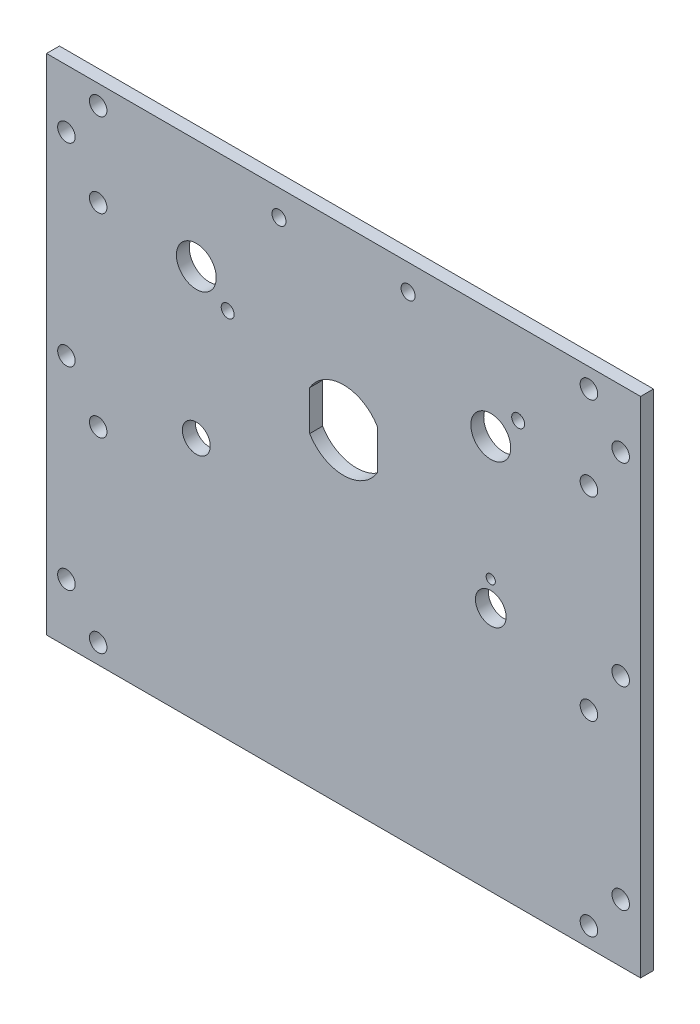
ISO-10303-21;
HEADER;
FILE_DESCRIPTION(('STEP AP214'),'2;1');
FILE_NAME('part.step','',(''),(''),'','','');
FILE_SCHEMA(('AUTOMOTIVE_DESIGN { 1 0 10303 214 1 1 1 1 }'));
ENDSEC;
DATA;
#1=APPLICATION_CONTEXT('core data for automotive mechanical design processes');
#2=APPLICATION_PROTOCOL_DEFINITION('international standard','automotive_design',2000,#1);
#3=PRODUCT_CONTEXT('',#1,'mechanical');
#4=PRODUCT('Part','Part','',(#3));
#5=PRODUCT_RELATED_PRODUCT_CATEGORY('part','',(#4));
#6=PRODUCT_DEFINITION_FORMATION('','',#4);
#7=PRODUCT_DEFINITION_CONTEXT('part definition',#1,'design');
#8=PRODUCT_DEFINITION('design','',#6,#7);
#9=PRODUCT_DEFINITION_SHAPE('','',#8);
#10=(LENGTH_UNIT() NAMED_UNIT(*) SI_UNIT(.MILLI.,.METRE.));
#11=(NAMED_UNIT(*) PLANE_ANGLE_UNIT() SI_UNIT($,.RADIAN.));
#12=(NAMED_UNIT(*) SI_UNIT($,.STERADIAN.) SOLID_ANGLE_UNIT());
#13=UNCERTAINTY_MEASURE_WITH_UNIT(LENGTH_MEASURE(1.E-05),#10,'distance_accuracy_value','');
#14=(GEOMETRIC_REPRESENTATION_CONTEXT(3) GLOBAL_UNCERTAINTY_ASSIGNED_CONTEXT((#13)) GLOBAL_UNIT_ASSIGNED_CONTEXT((#10,
#11,#12)) REPRESENTATION_CONTEXT('',''));
#15=CARTESIAN_POINT('',(0.,0.,0.));
#16=DIRECTION('',(0.,0.,1.));
#17=DIRECTION('',(1.,0.,0.));
#18=AXIS2_PLACEMENT_3D('',#15,#16,#17);
#19=CARTESIAN_POINT('',(0.,0.,-3.175));
#20=DIRECTION('',(1.,0.,0.));
#21=DIRECTION('',(0.,1.,0.));
#22=AXIS2_PLACEMENT_3D('',#19,#20,#21);
#23=PLANE('',#22);
#24=DIRECTION('',(0.,1.,0.));
#25=VECTOR('',#24,1.);
#26=CARTESIAN_POINT('',(0.,0.,0.));
#27=LINE('',#26,#25);
#28=CARTESIAN_POINT('',(0.,0.,0.));
#29=VERTEX_POINT('',#28);
#30=CARTESIAN_POINT('',(0.,123.825,0.));
#31=VERTEX_POINT('',#30);
#32=EDGE_CURVE('E317',#29,#31,#27,.T.);
#33=ORIENTED_EDGE('',*,*,#32,.F.);
#34=DIRECTION('',(0.,0.,1.));
#35=VECTOR('',#34,1.);
#36=CARTESIAN_POINT('',(0.,0.,-3.175));
#37=LINE('',#36,#35);
#38=CARTESIAN_POINT('',(0.,0.,-3.175));
#39=VERTEX_POINT('',#38);
#40=EDGE_CURVE('E11',#39,#29,#37,.T.);
#41=ORIENTED_EDGE('',*,*,#40,.F.);
#42=DIRECTION('',(0.,1.,0.));
#43=VECTOR('',#42,1.);
#44=CARTESIAN_POINT('',(0.,0.,-3.175));
#45=LINE('',#44,#43);
#46=CARTESIAN_POINT('',(0.,123.825,-3.175));
#47=VERTEX_POINT('',#46);
#48=EDGE_CURVE('E318',#39,#47,#45,.T.);
#49=ORIENTED_EDGE('',*,*,#48,.T.);
#50=DIRECTION('',(0.,0.,1.));
#51=VECTOR('',#50,1.);
#52=CARTESIAN_POINT('',(0.,123.825,-3.175));
#53=LINE('',#52,#51);
#54=EDGE_CURVE('E42',#47,#31,#53,.T.);
#55=ORIENTED_EDGE('',*,*,#54,.T.);
#56=EDGE_LOOP('',(#33,#41,#49,#55));
#57=FACE_BOUND('',#56,.T.);
#58=ADVANCED_FACE('F39',(#57),#23,.T.);
#59=CARTESIAN_POINT('',(-146.05,0.,-3.175));
#60=DIRECTION('',(0.,-1.,0.));
#61=DIRECTION('',(1.,0.,0.));
#62=AXIS2_PLACEMENT_3D('',#59,#60,#61);
#63=PLANE('',#62);
#64=DIRECTION('',(1.,0.,0.));
#65=VECTOR('',#64,1.);
#66=CARTESIAN_POINT('',(-146.05,0.,0.));
#67=LINE('',#66,#65);
#68=CARTESIAN_POINT('',(-146.05,0.,0.));
#69=VERTEX_POINT('',#68);
#70=EDGE_CURVE('E323',#69,#29,#67,.T.);
#71=ORIENTED_EDGE('',*,*,#70,.F.);
#72=DIRECTION('',(0.,0.,1.));
#73=VECTOR('',#72,1.);
#74=CARTESIAN_POINT('',(-146.05,0.,-3.175));
#75=LINE('',#74,#73);
#76=CARTESIAN_POINT('',(-146.05,0.,-3.175));
#77=VERTEX_POINT('',#76);
#78=EDGE_CURVE('E48',#77,#69,#75,.T.);
#79=ORIENTED_EDGE('',*,*,#78,.F.);
#80=DIRECTION('',(1.,0.,0.));
#81=VECTOR('',#80,1.);
#82=CARTESIAN_POINT('',(-146.05,0.,-3.175));
#83=LINE('',#82,#81);
#84=EDGE_CURVE('E331',#77,#39,#83,.T.);
#85=ORIENTED_EDGE('',*,*,#84,.T.);
#86=ORIENTED_EDGE('',*,*,#40,.T.);
#87=EDGE_LOOP('',(#71,#79,#85,#86));
#88=FACE_BOUND('',#87,.T.);
#89=ADVANCED_FACE('F364',(#88),#63,.T.);
#90=CARTESIAN_POINT('',(-146.05,123.825,-3.175));
#91=DIRECTION('',(-1.,0.,0.));
#92=DIRECTION('',(0.,0.,1.));
#93=AXIS2_PLACEMENT_3D('',#90,#91,#92);
#94=PLANE('',#93);
#95=DIRECTION('',(0.,-1.,0.));
#96=VECTOR('',#95,1.);
#97=CARTESIAN_POINT('',(-146.05,123.825,0.));
#98=LINE('',#97,#96);
#99=CARTESIAN_POINT('',(-146.05,123.825,0.));
#100=VERTEX_POINT('',#99);
#101=EDGE_CURVE('E342',#100,#69,#98,.T.);
#102=ORIENTED_EDGE('',*,*,#101,.F.);
#103=DIRECTION('',(0.,0.,1.));
#104=VECTOR('',#103,1.);
#105=CARTESIAN_POINT('',(-146.05,123.825,-3.175));
#106=LINE('',#105,#104);
#107=CARTESIAN_POINT('',(-146.05,123.825,-3.175));
#108=VERTEX_POINT('',#107);
#109=EDGE_CURVE('E350',#108,#100,#106,.T.);
#110=ORIENTED_EDGE('',*,*,#109,.F.);
#111=DIRECTION('',(0.,-1.,0.));
#112=VECTOR('',#111,1.);
#113=CARTESIAN_POINT('',(-146.05,123.825,-3.175));
#114=LINE('',#113,#112);
#115=EDGE_CURVE('E327',#108,#77,#114,.T.);
#116=ORIENTED_EDGE('',*,*,#115,.T.);
#117=ORIENTED_EDGE('',*,*,#78,.T.);
#118=EDGE_LOOP('',(#102,#110,#116,#117));
#119=FACE_BOUND('',#118,.T.);
#120=ADVANCED_FACE('F370',(#119),#94,.T.);
#121=CARTESIAN_POINT('',(0.,123.825,-3.175));
#122=DIRECTION('',(0.,1.,0.));
#123=DIRECTION('',(0.,0.,1.));
#124=AXIS2_PLACEMENT_3D('',#121,#122,#123);
#125=PLANE('',#124);
#126=DIRECTION('',(-1.,0.,0.));
#127=VECTOR('',#126,1.);
#128=CARTESIAN_POINT('',(0.,123.825,0.));
#129=LINE('',#128,#127);
#130=EDGE_CURVE('E338',#31,#100,#129,.T.);
#131=ORIENTED_EDGE('',*,*,#130,.F.);
#132=ORIENTED_EDGE('',*,*,#54,.F.);
#133=DIRECTION('',(-1.,0.,0.));
#134=VECTOR('',#133,1.);
#135=CARTESIAN_POINT('',(0.,123.825,-3.175));
#136=LINE('',#135,#134);
#137=EDGE_CURVE('E322',#47,#108,#136,.T.);
#138=ORIENTED_EDGE('',*,*,#137,.T.);
#139=ORIENTED_EDGE('',*,*,#109,.T.);
#140=EDGE_LOOP('',(#131,#132,#138,#139));
#141=FACE_BOUND('',#140,.T.);
#142=ADVANCED_FACE('F360',(#141),#125,.T.);
#143=CARTESIAN_POINT('',(0.,0.,-3.175));
#144=DIRECTION('',(0.,0.,1.));
#145=DIRECTION('',(1.,0.,0.));
#146=AXIS2_PLACEMENT_3D('',#143,#144,#145);
#147=PLANE('',#146);
#148=CARTESIAN_POINT('',(-88.9,117.475,-3.175));
#149=DIRECTION('',(0.,0.,1.));
#150=DIRECTION('',(1.,0.,0.));
#151=AXIS2_PLACEMENT_3D('',#148,#149,#150);
#152=CIRCLE('',#151,1.7272);
#153=CARTESIAN_POINT('',(-87.1728,117.475,-3.175));
#154=VERTEX_POINT('',#153);
#155=EDGE_CURVE('E685',#154,#154,#152,.T.);
#156=ORIENTED_EDGE('',*,*,#155,.T.);
#157=EDGE_LOOP('',(#156));
#158=FACE_BOUND('',#157,.T.);
#159=CARTESIAN_POINT('',(-57.15,117.475,-3.175));
#160=DIRECTION('',(0.,0.,1.));
#161=DIRECTION('',(1.,0.,0.));
#162=AXIS2_PLACEMENT_3D('',#159,#160,#161);
#163=CIRCLE('',#162,1.7272);
#164=CARTESIAN_POINT('',(-55.4228,117.475,-3.175));
#165=VERTEX_POINT('',#164);
#166=EDGE_CURVE('E698',#165,#165,#163,.T.);
#167=ORIENTED_EDGE('',*,*,#166,.T.);
#168=EDGE_LOOP('',(#167));
#169=FACE_BOUND('',#168,.T.);
#170=CARTESIAN_POINT('',(-30.094807909198,103.636192090802,-3.175));
#171=DIRECTION('',(0.,0.,-1.));
#172=DIRECTION('',(-1.,0.,0.));
#173=AXIS2_PLACEMENT_3D('',#170,#171,#172);
#174=CIRCLE('',#173,1.5875);
#175=CARTESIAN_POINT('',(-31.682307909198,103.636192090802,-3.175));
#176=VERTEX_POINT('',#175);
#177=EDGE_CURVE('E133',#176,#176,#174,.T.);
#178=ORIENTED_EDGE('',*,*,#177,.F.);
#179=EDGE_LOOP('',(#178));
#180=FACE_BOUND('',#179,.T.);
#181=DIRECTION('',(0.,-1.,0.));
#182=VECTOR('',#181,1.);
#183=CARTESIAN_POINT('',(-64.7065,75.2417306764591,-3.175));
#184=LINE('',#183,#182);
#185=CARTESIAN_POINT('',(-64.7065,85.0322693235408,-3.175));
#186=VERTEX_POINT('',#185);
#187=CARTESIAN_POINT('',(-64.7065,75.2417306764591,-3.175));
#188=VERTEX_POINT('',#187);
#189=EDGE_CURVE('E142',#186,#188,#184,.T.);
#190=ORIENTED_EDGE('',*,*,#189,.F.);
#191=CARTESIAN_POINT('',(-73.025,80.137,-3.175));
#192=DIRECTION('',(0.,0.,-1.));
#193=DIRECTION('',(-1.,0.,0.));
#194=AXIS2_PLACEMENT_3D('',#191,#192,#193);
#195=CIRCLE('',#194,9.652);
#196=CARTESIAN_POINT('',(-81.3435,85.0322693235408,-3.175));
#197=VERTEX_POINT('',#196);
#198=EDGE_CURVE('E56',#197,#186,#195,.T.);
#199=ORIENTED_EDGE('',*,*,#198,.F.);
#200=DIRECTION('',(0.,1.,0.));
#201=VECTOR('',#200,1.);
#202=CARTESIAN_POINT('',(-81.3435,85.0322693235408,-3.175));
#203=LINE('',#202,#201);
#204=CARTESIAN_POINT('',(-81.3435,75.2417306764592,-3.175));
#205=VERTEX_POINT('',#204);
#206=EDGE_CURVE('E126',#205,#197,#203,.T.);
#207=ORIENTED_EDGE('',*,*,#206,.F.);
#208=CARTESIAN_POINT('',(-73.025,80.137,-3.175));
#209=DIRECTION('',(0.,0.,-1.));
#210=DIRECTION('',(-1.,0.,0.));
#211=AXIS2_PLACEMENT_3D('',#208,#209,#210);
#212=CIRCLE('',#211,9.652);
#213=EDGE_CURVE('E130',#188,#205,#212,.T.);
#214=ORIENTED_EDGE('',*,*,#213,.F.);
#215=EDGE_LOOP('',(#190,#199,#207,#214));
#216=FACE_BOUND('',#215,.T.);
#217=CARTESIAN_POINT('',(-109.22,96.901,-3.175));
#218=DIRECTION('',(0.,0.,-1.));
#219=DIRECTION('',(-1.,0.,0.));
#220=AXIS2_PLACEMENT_3D('',#217,#218,#219);
#221=CIRCLE('',#220,4.9022);
#222=CARTESIAN_POINT('',(-114.1222,96.901,-3.175));
#223=VERTEX_POINT('',#222);
#224=EDGE_CURVE('E152',#223,#223,#221,.T.);
#225=ORIENTED_EDGE('',*,*,#224,.F.);
#226=EDGE_LOOP('',(#225));
#227=FACE_BOUND('',#226,.T.);
#228=CARTESIAN_POINT('',(-36.8300000273551,66.525,-3.175));
#229=DIRECTION('',(0.,0.,-1.));
#230=DIRECTION('',(-1.,0.,0.));
#231=AXIS2_PLACEMENT_3D('',#228,#229,#230);
#232=CIRCLE('',#231,1.125);
#233=CARTESIAN_POINT('',(-37.9550000273551,66.525,-3.175));
#234=VERTEX_POINT('',#233);
#235=EDGE_CURVE('E162',#234,#234,#232,.T.);
#236=ORIENTED_EDGE('',*,*,#235,.F.);
#237=EDGE_LOOP('',(#236));
#238=FACE_BOUND('',#237,.T.);
#239=CARTESIAN_POINT('',(-101.514113128579,91.3023454719142,-3.175));
#240=DIRECTION('',(0.,0.,-1.));
#241=DIRECTION('',(-1.,0.,0.));
#242=AXIS2_PLACEMENT_3D('',#239,#240,#241);
#243=CIRCLE('',#242,1.58749999999999);
#244=CARTESIAN_POINT('',(-103.101613128579,91.3023454719142,-3.175));
#245=VERTEX_POINT('',#244);
#246=EDGE_CURVE('E170',#245,#245,#243,.T.);
#247=ORIENTED_EDGE('',*,*,#246,.F.);
#248=EDGE_LOOP('',(#247));
#249=FACE_BOUND('',#248,.T.);
#250=CARTESIAN_POINT('',(-109.22,60.325,-3.175));
#251=DIRECTION('',(0.,0.,-1.));
#252=DIRECTION('',(-1.,0.,0.));
#253=AXIS2_PLACEMENT_3D('',#250,#251,#252);
#254=CIRCLE('',#253,3.429);
#255=CARTESIAN_POINT('',(-112.649,60.325,-3.175));
#256=VERTEX_POINT('',#255);
#257=EDGE_CURVE('E178',#256,#256,#254,.T.);
#258=ORIENTED_EDGE('',*,*,#257,.F.);
#259=EDGE_LOOP('',(#258));
#260=FACE_BOUND('',#259,.T.);
#261=CARTESIAN_POINT('',(-36.83,60.325,-3.175));
#262=DIRECTION('',(0.,0.,-1.));
#263=DIRECTION('',(-1.,0.,0.));
#264=AXIS2_PLACEMENT_3D('',#261,#262,#263);
#265=CIRCLE('',#264,3.7703125);
#266=CARTESIAN_POINT('',(-40.6003125,60.325,-3.175));
#267=VERTEX_POINT('',#266);
#268=EDGE_CURVE('E186',#267,#267,#265,.T.);
#269=ORIENTED_EDGE('',*,*,#268,.F.);
#270=EDGE_LOOP('',(#269));
#271=FACE_BOUND('',#270,.T.);
#272=CARTESIAN_POINT('',(-36.83,96.901,-3.175));
#273=DIRECTION('',(0.,0.,-1.));
#274=DIRECTION('',(-1.,0.,0.));
#275=AXIS2_PLACEMENT_3D('',#272,#273,#274);
#276=CIRCLE('',#275,4.90220000000001);
#277=CARTESIAN_POINT('',(-41.7322,96.901,-3.175));
#278=VERTEX_POINT('',#277);
#279=EDGE_CURVE('E194',#278,#278,#276,.T.);
#280=ORIENTED_EDGE('',*,*,#279,.F.);
#281=EDGE_LOOP('',(#280));
#282=FACE_BOUND('',#281,.T.);
#283=CARTESIAN_POINT('',(-12.7,119.0625,-3.175));
#284=DIRECTION('',(0.,0.,-1.));
#285=DIRECTION('',(-1.,0.,0.));
#286=AXIS2_PLACEMENT_3D('',#283,#284,#285);
#287=CIRCLE('',#286,2.15265);
#288=CARTESIAN_POINT('',(-14.85265,119.0625,-3.175));
#289=VERTEX_POINT('',#288);
#290=EDGE_CURVE('E202',#289,#289,#287,.T.);
#291=ORIENTED_EDGE('',*,*,#290,.F.);
#292=EDGE_LOOP('',(#291));
#293=FACE_BOUND('',#292,.T.);
#294=CARTESIAN_POINT('',(-133.35,119.0625,-3.175));
#295=DIRECTION('',(0.,0.,-1.));
#296=DIRECTION('',(-1.,0.,0.));
#297=AXIS2_PLACEMENT_3D('',#294,#295,#296);
#298=CIRCLE('',#297,2.15265000000001);
#299=CARTESIAN_POINT('',(-135.50265,119.0625,-3.175));
#300=VERTEX_POINT('',#299);
#301=EDGE_CURVE('E213',#300,#300,#298,.T.);
#302=ORIENTED_EDGE('',*,*,#301,.F.);
#303=EDGE_LOOP('',(#302));
#304=FACE_BOUND('',#303,.T.);
#305=CARTESIAN_POINT('',(-141.1605,109.5375,-3.175));
#306=DIRECTION('',(0.,0.,-1.));
#307=DIRECTION('',(-1.,0.,0.));
#308=AXIS2_PLACEMENT_3D('',#305,#306,#307);
#309=CIRCLE('',#308,2.15265000000001);
#310=CARTESIAN_POINT('',(-143.31315,109.5375,-3.175));
#311=VERTEX_POINT('',#310);
#312=EDGE_CURVE('E221',#311,#311,#309,.T.);
#313=ORIENTED_EDGE('',*,*,#312,.F.);
#314=EDGE_LOOP('',(#313));
#315=FACE_BOUND('',#314,.T.);
#316=CARTESIAN_POINT('',(-133.35,98.425,-3.175));
#317=DIRECTION('',(0.,0.,-1.));
#318=DIRECTION('',(-1.,0.,0.));
#319=AXIS2_PLACEMENT_3D('',#316,#317,#318);
#320=CIRCLE('',#319,2.15265000000001);
#321=CARTESIAN_POINT('',(-135.50265,98.425,-3.175));
#322=VERTEX_POINT('',#321);
#323=EDGE_CURVE('E229',#322,#322,#320,.T.);
#324=ORIENTED_EDGE('',*,*,#323,.F.);
#325=EDGE_LOOP('',(#324));
#326=FACE_BOUND('',#325,.T.);
#327=CARTESIAN_POINT('',(-141.1605,61.9125,-3.175));
#328=DIRECTION('',(0.,0.,-1.));
#329=DIRECTION('',(-1.,0.,0.));
#330=AXIS2_PLACEMENT_3D('',#327,#328,#329);
#331=CIRCLE('',#330,2.15265000000001);
#332=CARTESIAN_POINT('',(-143.31315,61.9125,-3.175));
#333=VERTEX_POINT('',#332);
#334=EDGE_CURVE('E237',#333,#333,#331,.T.);
#335=ORIENTED_EDGE('',*,*,#334,.F.);
#336=EDGE_LOOP('',(#335));
#337=FACE_BOUND('',#336,.T.);
#338=CARTESIAN_POINT('',(-133.35,50.673,-3.175));
#339=DIRECTION('',(0.,0.,-1.));
#340=DIRECTION('',(-1.,0.,0.));
#341=AXIS2_PLACEMENT_3D('',#338,#339,#340);
#342=CIRCLE('',#341,2.15265000000001);
#343=CARTESIAN_POINT('',(-135.50265,50.673,-3.175));
#344=VERTEX_POINT('',#343);
#345=EDGE_CURVE('E245',#344,#344,#342,.T.);
#346=ORIENTED_EDGE('',*,*,#345,.F.);
#347=EDGE_LOOP('',(#346));
#348=FACE_BOUND('',#347,.T.);
#349=CARTESIAN_POINT('',(-133.35,4.7625,-3.175));
#350=DIRECTION('',(0.,0.,-1.));
#351=DIRECTION('',(-1.,0.,0.));
#352=AXIS2_PLACEMENT_3D('',#349,#350,#351);
#353=CIRCLE('',#352,2.15265000000001);
#354=CARTESIAN_POINT('',(-135.50265,4.7625,-3.175));
#355=VERTEX_POINT('',#354);
#356=EDGE_CURVE('E253',#355,#355,#353,.T.);
#357=ORIENTED_EDGE('',*,*,#356,.F.);
#358=EDGE_LOOP('',(#357));
#359=FACE_BOUND('',#358,.T.);
#360=CARTESIAN_POINT('',(-12.7,4.7625,-3.175));
#361=DIRECTION('',(0.,0.,-1.));
#362=DIRECTION('',(-1.,0.,0.));
#363=AXIS2_PLACEMENT_3D('',#360,#361,#362);
#364=CIRCLE('',#363,2.15265);
#365=CARTESIAN_POINT('',(-14.85265,4.7625,-3.175));
#366=VERTEX_POINT('',#365);
#367=EDGE_CURVE('E261',#366,#366,#364,.T.);
#368=ORIENTED_EDGE('',*,*,#367,.F.);
#369=EDGE_LOOP('',(#368));
#370=FACE_BOUND('',#369,.T.);
#371=CARTESIAN_POINT('',(-12.7,50.673,-3.175));
#372=DIRECTION('',(0.,0.,-1.));
#373=DIRECTION('',(-1.,0.,0.));
#374=AXIS2_PLACEMENT_3D('',#371,#372,#373);
#375=CIRCLE('',#374,2.15265);
#376=CARTESIAN_POINT('',(-14.85265,50.673,-3.175));
#377=VERTEX_POINT('',#376);
#378=EDGE_CURVE('E269',#377,#377,#375,.T.);
#379=ORIENTED_EDGE('',*,*,#378,.F.);
#380=EDGE_LOOP('',(#379));
#381=FACE_BOUND('',#380,.T.);
#382=CARTESIAN_POINT('',(-12.7,98.425,-3.175));
#383=DIRECTION('',(0.,0.,-1.));
#384=DIRECTION('',(-1.,0.,0.));
#385=AXIS2_PLACEMENT_3D('',#382,#383,#384);
#386=CIRCLE('',#385,2.15265);
#387=CARTESIAN_POINT('',(-14.85265,98.425,-3.175));
#388=VERTEX_POINT('',#387);
#389=EDGE_CURVE('E277',#388,#388,#386,.T.);
#390=ORIENTED_EDGE('',*,*,#389,.F.);
#391=EDGE_LOOP('',(#390));
#392=FACE_BOUND('',#391,.T.);
#393=CARTESIAN_POINT('',(-4.8895,109.5375,-3.175));
#394=DIRECTION('',(0.,0.,-1.));
#395=DIRECTION('',(-1.,0.,0.));
#396=AXIS2_PLACEMENT_3D('',#393,#394,#395);
#397=CIRCLE('',#396,2.15265);
#398=CARTESIAN_POINT('',(-7.04215,109.5375,-3.175));
#399=VERTEX_POINT('',#398);
#400=EDGE_CURVE('E285',#399,#399,#397,.T.);
#401=ORIENTED_EDGE('',*,*,#400,.F.);
#402=EDGE_LOOP('',(#401));
#403=FACE_BOUND('',#402,.T.);
#404=CARTESIAN_POINT('',(-141.1605,14.2875,-3.175));
#405=DIRECTION('',(0.,0.,-1.));
#406=DIRECTION('',(-1.,0.,0.));
#407=AXIS2_PLACEMENT_3D('',#404,#405,#406);
#408=CIRCLE('',#407,2.15265000000001);
#409=CARTESIAN_POINT('',(-143.31315,14.2875,-3.175));
#410=VERTEX_POINT('',#409);
#411=EDGE_CURVE('E293',#410,#410,#408,.T.);
#412=ORIENTED_EDGE('',*,*,#411,.F.);
#413=EDGE_LOOP('',(#412));
#414=FACE_BOUND('',#413,.T.);
#415=CARTESIAN_POINT('',(-4.88949999999997,14.2875,-3.175));
#416=DIRECTION('',(0.,0.,-1.));
#417=DIRECTION('',(-1.,0.,0.));
#418=AXIS2_PLACEMENT_3D('',#415,#416,#417);
#419=CIRCLE('',#418,2.15265);
#420=CARTESIAN_POINT('',(-7.04214999999997,14.2875,-3.175));
#421=VERTEX_POINT('',#420);
#422=EDGE_CURVE('E301',#421,#421,#419,.T.);
#423=ORIENTED_EDGE('',*,*,#422,.F.);
#424=EDGE_LOOP('',(#423));
#425=FACE_BOUND('',#424,.T.);
#426=CARTESIAN_POINT('',(-4.8895,61.9125,-3.175));
#427=DIRECTION('',(0.,0.,-1.));
#428=DIRECTION('',(-1.,0.,0.));
#429=AXIS2_PLACEMENT_3D('',#426,#427,#428);
#430=CIRCLE('',#429,2.15265);
#431=CARTESIAN_POINT('',(-7.04215,61.9125,-3.175));
#432=VERTEX_POINT('',#431);
#433=EDGE_CURVE('E309',#432,#432,#430,.T.);
#434=ORIENTED_EDGE('',*,*,#433,.F.);
#435=EDGE_LOOP('',(#434));
#436=FACE_BOUND('',#435,.T.);
#437=ORIENTED_EDGE('',*,*,#48,.F.);
#438=ORIENTED_EDGE('',*,*,#84,.F.);
#439=ORIENTED_EDGE('',*,*,#115,.F.);
#440=ORIENTED_EDGE('',*,*,#137,.F.);
#441=EDGE_LOOP('',(#437,#438,#439,#440));
#442=FACE_BOUND('',#441,.T.);
#443=ADVANCED_FACE('F367',(#158,#169,#180,#216,#227,#238,#249,#260,#271,#282,#293,#304,#315,
#326,#337,#348,#359,#370,#381,#392,#403,#414,#425,#436,#442),#147,.F.);
#444=CARTESIAN_POINT('',(0.,0.,0.));
#445=DIRECTION('',(0.,0.,1.));
#446=DIRECTION('',(1.,0.,0.));
#447=AXIS2_PLACEMENT_3D('',#444,#445,#446);
#448=PLANE('',#447);
#449=CARTESIAN_POINT('',(-88.9,117.475,0.));
#450=DIRECTION('',(0.,0.,1.));
#451=DIRECTION('',(1.,0.,0.));
#452=AXIS2_PLACEMENT_3D('',#449,#450,#451);
#453=CIRCLE('',#452,1.7272);
#454=CARTESIAN_POINT('',(-87.1728,117.475,0.));
#455=VERTEX_POINT('',#454);
#456=EDGE_CURVE('E688',#455,#455,#453,.T.);
#457=ORIENTED_EDGE('',*,*,#456,.F.);
#458=EDGE_LOOP('',(#457));
#459=FACE_BOUND('',#458,.T.);
#460=CARTESIAN_POINT('',(-57.15,117.475,0.));
#461=DIRECTION('',(0.,0.,1.));
#462=DIRECTION('',(1.,0.,0.));
#463=AXIS2_PLACEMENT_3D('',#460,#461,#462);
#464=CIRCLE('',#463,1.7272);
#465=CARTESIAN_POINT('',(-55.4228,117.475,0.));
#466=VERTEX_POINT('',#465);
#467=EDGE_CURVE('E692',#466,#466,#464,.T.);
#468=ORIENTED_EDGE('',*,*,#467,.F.);
#469=EDGE_LOOP('',(#468));
#470=FACE_BOUND('',#469,.T.);
#471=CARTESIAN_POINT('',(-30.094807909198,103.636192090802,0.));
#472=DIRECTION('',(0.,0.,-1.));
#473=DIRECTION('',(-1.,0.,0.));
#474=AXIS2_PLACEMENT_3D('',#471,#472,#473);
#475=CIRCLE('',#474,1.5875);
#476=CARTESIAN_POINT('',(-31.682307909198,103.636192090802,0.));
#477=VERTEX_POINT('',#476);
#478=EDGE_CURVE('E143',#477,#477,#475,.T.);
#479=ORIENTED_EDGE('',*,*,#478,.T.);
#480=EDGE_LOOP('',(#479));
#481=FACE_BOUND('',#480,.T.);
#482=CARTESIAN_POINT('',(-73.025,80.137,0.));
#483=DIRECTION('',(0.,0.,-1.));
#484=DIRECTION('',(-1.,0.,0.));
#485=AXIS2_PLACEMENT_3D('',#482,#483,#484);
#486=CIRCLE('',#485,9.652);
#487=CARTESIAN_POINT('',(-81.3435,85.0322693235408,0.));
#488=VERTEX_POINT('',#487);
#489=CARTESIAN_POINT('',(-64.7065,85.0322693235408,0.));
#490=VERTEX_POINT('',#489);
#491=EDGE_CURVE('E107',#488,#490,#486,.T.);
#492=ORIENTED_EDGE('',*,*,#491,.T.);
#493=DIRECTION('',(0.,-1.,0.));
#494=VECTOR('',#493,1.);
#495=CARTESIAN_POINT('',(-64.7065,75.2417306764591,0.));
#496=LINE('',#495,#494);
#497=CARTESIAN_POINT('',(-64.7065,75.2417306764591,0.));
#498=VERTEX_POINT('',#497);
#499=EDGE_CURVE('E117',#490,#498,#496,.T.);
#500=ORIENTED_EDGE('',*,*,#499,.T.);
#501=CARTESIAN_POINT('',(-73.025,80.137,0.));
#502=DIRECTION('',(0.,0.,-1.));
#503=DIRECTION('',(-1.,0.,0.));
#504=AXIS2_PLACEMENT_3D('',#501,#502,#503);
#505=CIRCLE('',#504,9.652);
#506=CARTESIAN_POINT('',(-81.3435,75.2417306764592,0.));
#507=VERTEX_POINT('',#506);
#508=EDGE_CURVE('E64',#498,#507,#505,.T.);
#509=ORIENTED_EDGE('',*,*,#508,.T.);
#510=DIRECTION('',(0.,1.,0.));
#511=VECTOR('',#510,1.);
#512=CARTESIAN_POINT('',(-81.3435,85.0322693235408,0.));
#513=LINE('',#512,#511);
#514=EDGE_CURVE('E114',#507,#488,#513,.T.);
#515=ORIENTED_EDGE('',*,*,#514,.T.);
#516=EDGE_LOOP('',(#492,#500,#509,#515));
#517=FACE_BOUND('',#516,.T.);
#518=CARTESIAN_POINT('',(-109.22,96.901,0.));
#519=DIRECTION('',(0.,0.,-1.));
#520=DIRECTION('',(-1.,0.,0.));
#521=AXIS2_PLACEMENT_3D('',#518,#519,#520);
#522=CIRCLE('',#521,4.9022);
#523=CARTESIAN_POINT('',(-114.1222,96.901,0.));
#524=VERTEX_POINT('',#523);
#525=EDGE_CURVE('E158',#524,#524,#522,.T.);
#526=ORIENTED_EDGE('',*,*,#525,.T.);
#527=EDGE_LOOP('',(#526));
#528=FACE_BOUND('',#527,.T.);
#529=CARTESIAN_POINT('',(-36.8300000273551,66.525,0.));
#530=DIRECTION('',(0.,0.,-1.));
#531=DIRECTION('',(-1.,0.,0.));
#532=AXIS2_PLACEMENT_3D('',#529,#530,#531);
#533=CIRCLE('',#532,1.125);
#534=CARTESIAN_POINT('',(-37.9550000273551,66.525,0.));
#535=VERTEX_POINT('',#534);
#536=EDGE_CURVE('E166',#535,#535,#533,.T.);
#537=ORIENTED_EDGE('',*,*,#536,.T.);
#538=EDGE_LOOP('',(#537));
#539=FACE_BOUND('',#538,.T.);
#540=CARTESIAN_POINT('',(-101.514113128579,91.3023454719142,0.));
#541=DIRECTION('',(0.,0.,-1.));
#542=DIRECTION('',(-1.,0.,0.));
#543=AXIS2_PLACEMENT_3D('',#540,#541,#542);
#544=CIRCLE('',#543,1.58749999999999);
#545=CARTESIAN_POINT('',(-103.101613128579,91.3023454719142,0.));
#546=VERTEX_POINT('',#545);
#547=EDGE_CURVE('E174',#546,#546,#544,.T.);
#548=ORIENTED_EDGE('',*,*,#547,.T.);
#549=EDGE_LOOP('',(#548));
#550=FACE_BOUND('',#549,.T.);
#551=CARTESIAN_POINT('',(-109.22,60.325,0.));
#552=DIRECTION('',(0.,0.,-1.));
#553=DIRECTION('',(-1.,0.,0.));
#554=AXIS2_PLACEMENT_3D('',#551,#552,#553);
#555=CIRCLE('',#554,3.429);
#556=CARTESIAN_POINT('',(-112.649,60.325,0.));
#557=VERTEX_POINT('',#556);
#558=EDGE_CURVE('E182',#557,#557,#555,.T.);
#559=ORIENTED_EDGE('',*,*,#558,.T.);
#560=EDGE_LOOP('',(#559));
#561=FACE_BOUND('',#560,.T.);
#562=CARTESIAN_POINT('',(-36.83,60.325,0.));
#563=DIRECTION('',(0.,0.,-1.));
#564=DIRECTION('',(-1.,0.,0.));
#565=AXIS2_PLACEMENT_3D('',#562,#563,#564);
#566=CIRCLE('',#565,3.7703125);
#567=CARTESIAN_POINT('',(-40.6003125,60.325,0.));
#568=VERTEX_POINT('',#567);
#569=EDGE_CURVE('E190',#568,#568,#566,.T.);
#570=ORIENTED_EDGE('',*,*,#569,.T.);
#571=EDGE_LOOP('',(#570));
#572=FACE_BOUND('',#571,.T.);
#573=CARTESIAN_POINT('',(-36.83,96.901,0.));
#574=DIRECTION('',(0.,0.,-1.));
#575=DIRECTION('',(-1.,0.,0.));
#576=AXIS2_PLACEMENT_3D('',#573,#574,#575);
#577=CIRCLE('',#576,4.90220000000001);
#578=CARTESIAN_POINT('',(-41.7322,96.901,0.));
#579=VERTEX_POINT('',#578);
#580=EDGE_CURVE('E198',#579,#579,#577,.T.);
#581=ORIENTED_EDGE('',*,*,#580,.T.);
#582=EDGE_LOOP('',(#581));
#583=FACE_BOUND('',#582,.T.);
#584=CARTESIAN_POINT('',(-12.7,119.0625,0.));
#585=DIRECTION('',(0.,0.,-1.));
#586=DIRECTION('',(-1.,0.,0.));
#587=AXIS2_PLACEMENT_3D('',#584,#585,#586);
#588=CIRCLE('',#587,2.15265);
#589=CARTESIAN_POINT('',(-14.85265,119.0625,0.));
#590=VERTEX_POINT('',#589);
#591=EDGE_CURVE('E209',#590,#590,#588,.T.);
#592=ORIENTED_EDGE('',*,*,#591,.T.);
#593=EDGE_LOOP('',(#592));
#594=FACE_BOUND('',#593,.T.);
#595=CARTESIAN_POINT('',(-133.35,119.0625,0.));
#596=DIRECTION('',(0.,0.,-1.));
#597=DIRECTION('',(-1.,0.,0.));
#598=AXIS2_PLACEMENT_3D('',#595,#596,#597);
#599=CIRCLE('',#598,2.15265000000001);
#600=CARTESIAN_POINT('',(-135.50265,119.0625,0.));
#601=VERTEX_POINT('',#600);
#602=EDGE_CURVE('E217',#601,#601,#599,.T.);
#603=ORIENTED_EDGE('',*,*,#602,.T.);
#604=EDGE_LOOP('',(#603));
#605=FACE_BOUND('',#604,.T.);
#606=CARTESIAN_POINT('',(-141.1605,109.5375,0.));
#607=DIRECTION('',(0.,0.,-1.));
#608=DIRECTION('',(-1.,0.,0.));
#609=AXIS2_PLACEMENT_3D('',#606,#607,#608);
#610=CIRCLE('',#609,2.15265000000001);
#611=CARTESIAN_POINT('',(-143.31315,109.5375,0.));
#612=VERTEX_POINT('',#611);
#613=EDGE_CURVE('E225',#612,#612,#610,.T.);
#614=ORIENTED_EDGE('',*,*,#613,.T.);
#615=EDGE_LOOP('',(#614));
#616=FACE_BOUND('',#615,.T.);
#617=CARTESIAN_POINT('',(-133.35,98.425,0.));
#618=DIRECTION('',(0.,0.,-1.));
#619=DIRECTION('',(-1.,0.,0.));
#620=AXIS2_PLACEMENT_3D('',#617,#618,#619);
#621=CIRCLE('',#620,2.15265000000001);
#622=CARTESIAN_POINT('',(-135.50265,98.425,0.));
#623=VERTEX_POINT('',#622);
#624=EDGE_CURVE('E233',#623,#623,#621,.T.);
#625=ORIENTED_EDGE('',*,*,#624,.T.);
#626=EDGE_LOOP('',(#625));
#627=FACE_BOUND('',#626,.T.);
#628=CARTESIAN_POINT('',(-141.1605,61.9125,0.));
#629=DIRECTION('',(0.,0.,-1.));
#630=DIRECTION('',(-1.,0.,0.));
#631=AXIS2_PLACEMENT_3D('',#628,#629,#630);
#632=CIRCLE('',#631,2.15265000000001);
#633=CARTESIAN_POINT('',(-143.31315,61.9125,0.));
#634=VERTEX_POINT('',#633);
#635=EDGE_CURVE('E241',#634,#634,#632,.T.);
#636=ORIENTED_EDGE('',*,*,#635,.T.);
#637=EDGE_LOOP('',(#636));
#638=FACE_BOUND('',#637,.T.);
#639=CARTESIAN_POINT('',(-133.35,50.673,0.));
#640=DIRECTION('',(0.,0.,-1.));
#641=DIRECTION('',(-1.,0.,0.));
#642=AXIS2_PLACEMENT_3D('',#639,#640,#641);
#643=CIRCLE('',#642,2.15265000000001);
#644=CARTESIAN_POINT('',(-135.50265,50.673,0.));
#645=VERTEX_POINT('',#644);
#646=EDGE_CURVE('E249',#645,#645,#643,.T.);
#647=ORIENTED_EDGE('',*,*,#646,.T.);
#648=EDGE_LOOP('',(#647));
#649=FACE_BOUND('',#648,.T.);
#650=CARTESIAN_POINT('',(-133.35,4.7625,0.));
#651=DIRECTION('',(0.,0.,-1.));
#652=DIRECTION('',(-1.,0.,0.));
#653=AXIS2_PLACEMENT_3D('',#650,#651,#652);
#654=CIRCLE('',#653,2.15265000000001);
#655=CARTESIAN_POINT('',(-135.50265,4.7625,0.));
#656=VERTEX_POINT('',#655);
#657=EDGE_CURVE('E257',#656,#656,#654,.T.);
#658=ORIENTED_EDGE('',*,*,#657,.T.);
#659=EDGE_LOOP('',(#658));
#660=FACE_BOUND('',#659,.T.);
#661=CARTESIAN_POINT('',(-12.7,4.7625,0.));
#662=DIRECTION('',(0.,0.,-1.));
#663=DIRECTION('',(-1.,0.,0.));
#664=AXIS2_PLACEMENT_3D('',#661,#662,#663);
#665=CIRCLE('',#664,2.15265);
#666=CARTESIAN_POINT('',(-14.85265,4.7625,0.));
#667=VERTEX_POINT('',#666);
#668=EDGE_CURVE('E265',#667,#667,#665,.T.);
#669=ORIENTED_EDGE('',*,*,#668,.T.);
#670=EDGE_LOOP('',(#669));
#671=FACE_BOUND('',#670,.T.);
#672=CARTESIAN_POINT('',(-12.7,50.673,0.));
#673=DIRECTION('',(0.,0.,-1.));
#674=DIRECTION('',(-1.,0.,0.));
#675=AXIS2_PLACEMENT_3D('',#672,#673,#674);
#676=CIRCLE('',#675,2.15265);
#677=CARTESIAN_POINT('',(-14.85265,50.673,0.));
#678=VERTEX_POINT('',#677);
#679=EDGE_CURVE('E273',#678,#678,#676,.T.);
#680=ORIENTED_EDGE('',*,*,#679,.T.);
#681=EDGE_LOOP('',(#680));
#682=FACE_BOUND('',#681,.T.);
#683=CARTESIAN_POINT('',(-12.7,98.425,0.));
#684=DIRECTION('',(0.,0.,-1.));
#685=DIRECTION('',(-1.,0.,0.));
#686=AXIS2_PLACEMENT_3D('',#683,#684,#685);
#687=CIRCLE('',#686,2.15265);
#688=CARTESIAN_POINT('',(-14.85265,98.425,0.));
#689=VERTEX_POINT('',#688);
#690=EDGE_CURVE('E281',#689,#689,#687,.T.);
#691=ORIENTED_EDGE('',*,*,#690,.T.);
#692=EDGE_LOOP('',(#691));
#693=FACE_BOUND('',#692,.T.);
#694=CARTESIAN_POINT('',(-4.8895,109.5375,0.));
#695=DIRECTION('',(0.,0.,-1.));
#696=DIRECTION('',(-1.,0.,0.));
#697=AXIS2_PLACEMENT_3D('',#694,#695,#696);
#698=CIRCLE('',#697,2.15265);
#699=CARTESIAN_POINT('',(-7.04215,109.5375,0.));
#700=VERTEX_POINT('',#699);
#701=EDGE_CURVE('E289',#700,#700,#698,.T.);
#702=ORIENTED_EDGE('',*,*,#701,.T.);
#703=EDGE_LOOP('',(#702));
#704=FACE_BOUND('',#703,.T.);
#705=CARTESIAN_POINT('',(-141.1605,14.2875,0.));
#706=DIRECTION('',(0.,0.,-1.));
#707=DIRECTION('',(-1.,0.,0.));
#708=AXIS2_PLACEMENT_3D('',#705,#706,#707);
#709=CIRCLE('',#708,2.15265000000001);
#710=CARTESIAN_POINT('',(-143.31315,14.2875,0.));
#711=VERTEX_POINT('',#710);
#712=EDGE_CURVE('E297',#711,#711,#709,.T.);
#713=ORIENTED_EDGE('',*,*,#712,.T.);
#714=EDGE_LOOP('',(#713));
#715=FACE_BOUND('',#714,.T.);
#716=CARTESIAN_POINT('',(-4.88949999999997,14.2875,0.));
#717=DIRECTION('',(0.,0.,-1.));
#718=DIRECTION('',(-1.,0.,0.));
#719=AXIS2_PLACEMENT_3D('',#716,#717,#718);
#720=CIRCLE('',#719,2.15265);
#721=CARTESIAN_POINT('',(-7.04214999999997,14.2875,0.));
#722=VERTEX_POINT('',#721);
#723=EDGE_CURVE('E305',#722,#722,#720,.T.);
#724=ORIENTED_EDGE('',*,*,#723,.T.);
#725=EDGE_LOOP('',(#724));
#726=FACE_BOUND('',#725,.T.);
#727=CARTESIAN_POINT('',(-4.8895,61.9125,0.));
#728=DIRECTION('',(0.,0.,-1.));
#729=DIRECTION('',(-1.,0.,0.));
#730=AXIS2_PLACEMENT_3D('',#727,#728,#729);
#731=CIRCLE('',#730,2.15265);
#732=CARTESIAN_POINT('',(-7.04215,61.9125,0.));
#733=VERTEX_POINT('',#732);
#734=EDGE_CURVE('E313',#733,#733,#731,.T.);
#735=ORIENTED_EDGE('',*,*,#734,.T.);
#736=EDGE_LOOP('',(#735));
#737=FACE_BOUND('',#736,.T.);
#738=ORIENTED_EDGE('',*,*,#32,.T.);
#739=ORIENTED_EDGE('',*,*,#130,.T.);
#740=ORIENTED_EDGE('',*,*,#101,.T.);
#741=ORIENTED_EDGE('',*,*,#70,.T.);
#742=EDGE_LOOP('',(#738,#739,#740,#741));
#743=FACE_BOUND('',#742,.T.);
#744=ADVANCED_FACE('F122',(#459,#470,#481,#517,#528,#539,#550,#561,#572,#583,#594,#605,#616,
#627,#638,#649,#660,#671,#682,#693,#704,#715,#726,#737,#743),#448,.T.);
#745=CARTESIAN_POINT('',(-4.8895,61.9125,-3.175));
#746=DIRECTION('',(0.,0.,-1.));
#747=DIRECTION('',(-1.,0.,0.));
#748=AXIS2_PLACEMENT_3D('',#745,#746,#747);
#749=CYLINDRICAL_SURFACE('',#748,2.15265);
#750=ORIENTED_EDGE('',*,*,#734,.F.);
#751=EDGE_LOOP('',(#750));
#752=FACE_BOUND('',#751,.T.);
#753=ORIENTED_EDGE('',*,*,#433,.T.);
#754=EDGE_LOOP('',(#753));
#755=FACE_BOUND('',#754,.T.);
#756=ADVANCED_FACE('F402',(#752,#755),#749,.F.);
#757=CARTESIAN_POINT('',(-4.88949999999997,14.2875,-3.175));
#758=DIRECTION('',(0.,0.,-1.));
#759=DIRECTION('',(-1.,0.,0.));
#760=AXIS2_PLACEMENT_3D('',#757,#758,#759);
#761=CYLINDRICAL_SURFACE('',#760,2.15265);
#762=ORIENTED_EDGE('',*,*,#723,.F.);
#763=EDGE_LOOP('',(#762));
#764=FACE_BOUND('',#763,.T.);
#765=ORIENTED_EDGE('',*,*,#422,.T.);
#766=EDGE_LOOP('',(#765));
#767=FACE_BOUND('',#766,.T.);
#768=ADVANCED_FACE('F407',(#764,#767),#761,.F.);
#769=CARTESIAN_POINT('',(-141.1605,14.2875,-3.175));
#770=DIRECTION('',(0.,0.,-1.));
#771=DIRECTION('',(-1.,0.,0.));
#772=AXIS2_PLACEMENT_3D('',#769,#770,#771);
#773=CYLINDRICAL_SURFACE('',#772,2.15265000000001);
#774=ORIENTED_EDGE('',*,*,#712,.F.);
#775=EDGE_LOOP('',(#774));
#776=FACE_BOUND('',#775,.T.);
#777=ORIENTED_EDGE('',*,*,#411,.T.);
#778=EDGE_LOOP('',(#777));
#779=FACE_BOUND('',#778,.T.);
#780=ADVANCED_FACE('F419',(#776,#779),#773,.F.);
#781=CARTESIAN_POINT('',(-4.8895,109.5375,-3.175));
#782=DIRECTION('',(0.,0.,-1.));
#783=DIRECTION('',(-1.,0.,0.));
#784=AXIS2_PLACEMENT_3D('',#781,#782,#783);
#785=CYLINDRICAL_SURFACE('',#784,2.15265);
#786=ORIENTED_EDGE('',*,*,#701,.F.);
#787=EDGE_LOOP('',(#786));
#788=FACE_BOUND('',#787,.T.);
#789=ORIENTED_EDGE('',*,*,#400,.T.);
#790=EDGE_LOOP('',(#789));
#791=FACE_BOUND('',#790,.T.);
#792=ADVANCED_FACE('F429',(#788,#791),#785,.F.);
#793=CARTESIAN_POINT('',(-12.7,98.425,-3.175));
#794=DIRECTION('',(0.,0.,-1.));
#795=DIRECTION('',(-1.,0.,0.));
#796=AXIS2_PLACEMENT_3D('',#793,#794,#795);
#797=CYLINDRICAL_SURFACE('',#796,2.15265);
#798=ORIENTED_EDGE('',*,*,#690,.F.);
#799=EDGE_LOOP('',(#798));
#800=FACE_BOUND('',#799,.T.);
#801=ORIENTED_EDGE('',*,*,#389,.T.);
#802=EDGE_LOOP('',(#801));
#803=FACE_BOUND('',#802,.T.);
#804=ADVANCED_FACE('F439',(#800,#803),#797,.F.);
#805=CARTESIAN_POINT('',(-12.7,50.673,-3.175));
#806=DIRECTION('',(0.,0.,-1.));
#807=DIRECTION('',(-1.,0.,0.));
#808=AXIS2_PLACEMENT_3D('',#805,#806,#807);
#809=CYLINDRICAL_SURFACE('',#808,2.15265);
#810=ORIENTED_EDGE('',*,*,#679,.F.);
#811=EDGE_LOOP('',(#810));
#812=FACE_BOUND('',#811,.T.);
#813=ORIENTED_EDGE('',*,*,#378,.T.);
#814=EDGE_LOOP('',(#813));
#815=FACE_BOUND('',#814,.T.);
#816=ADVANCED_FACE('F449',(#812,#815),#809,.F.);
#817=CARTESIAN_POINT('',(-12.7,4.7625,-3.175));
#818=DIRECTION('',(0.,0.,-1.));
#819=DIRECTION('',(-1.,0.,0.));
#820=AXIS2_PLACEMENT_3D('',#817,#818,#819);
#821=CYLINDRICAL_SURFACE('',#820,2.15265);
#822=ORIENTED_EDGE('',*,*,#668,.F.);
#823=EDGE_LOOP('',(#822));
#824=FACE_BOUND('',#823,.T.);
#825=ORIENTED_EDGE('',*,*,#367,.T.);
#826=EDGE_LOOP('',(#825));
#827=FACE_BOUND('',#826,.T.);
#828=ADVANCED_FACE('F459',(#824,#827),#821,.F.);
#829=CARTESIAN_POINT('',(-133.35,4.7625,-3.175));
#830=DIRECTION('',(0.,0.,-1.));
#831=DIRECTION('',(-1.,0.,0.));
#832=AXIS2_PLACEMENT_3D('',#829,#830,#831);
#833=CYLINDRICAL_SURFACE('',#832,2.15265000000001);
#834=ORIENTED_EDGE('',*,*,#657,.F.);
#835=EDGE_LOOP('',(#834));
#836=FACE_BOUND('',#835,.T.);
#837=ORIENTED_EDGE('',*,*,#356,.T.);
#838=EDGE_LOOP('',(#837));
#839=FACE_BOUND('',#838,.T.);
#840=ADVANCED_FACE('F469',(#836,#839),#833,.F.);
#841=CARTESIAN_POINT('',(-133.35,50.673,-3.175));
#842=DIRECTION('',(0.,0.,-1.));
#843=DIRECTION('',(-1.,0.,0.));
#844=AXIS2_PLACEMENT_3D('',#841,#842,#843);
#845=CYLINDRICAL_SURFACE('',#844,2.15265000000001);
#846=ORIENTED_EDGE('',*,*,#646,.F.);
#847=EDGE_LOOP('',(#846));
#848=FACE_BOUND('',#847,.T.);
#849=ORIENTED_EDGE('',*,*,#345,.T.);
#850=EDGE_LOOP('',(#849));
#851=FACE_BOUND('',#850,.T.);
#852=ADVANCED_FACE('F479',(#848,#851),#845,.F.);
#853=CARTESIAN_POINT('',(-141.1605,61.9125,-3.175));
#854=DIRECTION('',(0.,0.,-1.));
#855=DIRECTION('',(-1.,0.,0.));
#856=AXIS2_PLACEMENT_3D('',#853,#854,#855);
#857=CYLINDRICAL_SURFACE('',#856,2.15265000000001);
#858=ORIENTED_EDGE('',*,*,#635,.F.);
#859=EDGE_LOOP('',(#858));
#860=FACE_BOUND('',#859,.T.);
#861=ORIENTED_EDGE('',*,*,#334,.T.);
#862=EDGE_LOOP('',(#861));
#863=FACE_BOUND('',#862,.T.);
#864=ADVANCED_FACE('F489',(#860,#863),#857,.F.);
#865=CARTESIAN_POINT('',(-133.35,98.425,-3.175));
#866=DIRECTION('',(0.,0.,-1.));
#867=DIRECTION('',(-1.,0.,0.));
#868=AXIS2_PLACEMENT_3D('',#865,#866,#867);
#869=CYLINDRICAL_SURFACE('',#868,2.15265000000001);
#870=ORIENTED_EDGE('',*,*,#624,.F.);
#871=EDGE_LOOP('',(#870));
#872=FACE_BOUND('',#871,.T.);
#873=ORIENTED_EDGE('',*,*,#323,.T.);
#874=EDGE_LOOP('',(#873));
#875=FACE_BOUND('',#874,.T.);
#876=ADVANCED_FACE('F499',(#872,#875),#869,.F.);
#877=CARTESIAN_POINT('',(-141.1605,109.5375,-3.175));
#878=DIRECTION('',(0.,0.,-1.));
#879=DIRECTION('',(-1.,0.,0.));
#880=AXIS2_PLACEMENT_3D('',#877,#878,#879);
#881=CYLINDRICAL_SURFACE('',#880,2.15265000000001);
#882=ORIENTED_EDGE('',*,*,#613,.F.);
#883=EDGE_LOOP('',(#882));
#884=FACE_BOUND('',#883,.T.);
#885=ORIENTED_EDGE('',*,*,#312,.T.);
#886=EDGE_LOOP('',(#885));
#887=FACE_BOUND('',#886,.T.);
#888=ADVANCED_FACE('F509',(#884,#887),#881,.F.);
#889=CARTESIAN_POINT('',(-133.35,119.0625,-3.175));
#890=DIRECTION('',(0.,0.,-1.));
#891=DIRECTION('',(-1.,0.,0.));
#892=AXIS2_PLACEMENT_3D('',#889,#890,#891);
#893=CYLINDRICAL_SURFACE('',#892,2.15265000000001);
#894=ORIENTED_EDGE('',*,*,#602,.F.);
#895=EDGE_LOOP('',(#894));
#896=FACE_BOUND('',#895,.T.);
#897=ORIENTED_EDGE('',*,*,#301,.T.);
#898=EDGE_LOOP('',(#897));
#899=FACE_BOUND('',#898,.T.);
#900=ADVANCED_FACE('F519',(#896,#899),#893,.F.);
#901=CARTESIAN_POINT('',(-12.7,119.0625,-3.175));
#902=DIRECTION('',(0.,0.,-1.));
#903=DIRECTION('',(-1.,0.,0.));
#904=AXIS2_PLACEMENT_3D('',#901,#902,#903);
#905=CYLINDRICAL_SURFACE('',#904,2.15265);
#906=ORIENTED_EDGE('',*,*,#591,.F.);
#907=EDGE_LOOP('',(#906));
#908=FACE_BOUND('',#907,.T.);
#909=ORIENTED_EDGE('',*,*,#290,.T.);
#910=EDGE_LOOP('',(#909));
#911=FACE_BOUND('',#910,.T.);
#912=ADVANCED_FACE('F529',(#908,#911),#905,.F.);
#913=CARTESIAN_POINT('',(-36.83,96.901,0.));
#914=DIRECTION('',(0.,0.,-1.));
#915=DIRECTION('',(-1.,0.,0.));
#916=AXIS2_PLACEMENT_3D('',#913,#914,#915);
#917=CYLINDRICAL_SURFACE('',#916,4.90220000000001);
#918=ORIENTED_EDGE('',*,*,#580,.F.);
#919=EDGE_LOOP('',(#918));
#920=FACE_BOUND('',#919,.T.);
#921=ORIENTED_EDGE('',*,*,#279,.T.);
#922=EDGE_LOOP('',(#921));
#923=FACE_BOUND('',#922,.T.);
#924=ADVANCED_FACE('F539',(#920,#923),#917,.F.);
#925=CARTESIAN_POINT('',(-36.83,60.325,0.));
#926=DIRECTION('',(0.,0.,-1.));
#927=DIRECTION('',(-1.,0.,0.));
#928=AXIS2_PLACEMENT_3D('',#925,#926,#927);
#929=CYLINDRICAL_SURFACE('',#928,3.7703125);
#930=ORIENTED_EDGE('',*,*,#569,.F.);
#931=EDGE_LOOP('',(#930));
#932=FACE_BOUND('',#931,.T.);
#933=ORIENTED_EDGE('',*,*,#268,.T.);
#934=EDGE_LOOP('',(#933));
#935=FACE_BOUND('',#934,.T.);
#936=ADVANCED_FACE('F549',(#932,#935),#929,.F.);
#937=CARTESIAN_POINT('',(-109.22,60.325,0.));
#938=DIRECTION('',(0.,0.,-1.));
#939=DIRECTION('',(-1.,0.,0.));
#940=AXIS2_PLACEMENT_3D('',#937,#938,#939);
#941=CYLINDRICAL_SURFACE('',#940,3.429);
#942=ORIENTED_EDGE('',*,*,#558,.F.);
#943=EDGE_LOOP('',(#942));
#944=FACE_BOUND('',#943,.T.);
#945=ORIENTED_EDGE('',*,*,#257,.T.);
#946=EDGE_LOOP('',(#945));
#947=FACE_BOUND('',#946,.T.);
#948=ADVANCED_FACE('F559',(#944,#947),#941,.F.);
#949=CARTESIAN_POINT('',(-101.514113128579,91.3023454719142,0.));
#950=DIRECTION('',(0.,0.,-1.));
#951=DIRECTION('',(-1.,0.,0.));
#952=AXIS2_PLACEMENT_3D('',#949,#950,#951);
#953=CYLINDRICAL_SURFACE('',#952,1.58749999999999);
#954=ORIENTED_EDGE('',*,*,#547,.F.);
#955=EDGE_LOOP('',(#954));
#956=FACE_BOUND('',#955,.T.);
#957=ORIENTED_EDGE('',*,*,#246,.T.);
#958=EDGE_LOOP('',(#957));
#959=FACE_BOUND('',#958,.T.);
#960=ADVANCED_FACE('F569',(#956,#959),#953,.F.);
#961=CARTESIAN_POINT('',(-36.8300000273551,66.525,0.));
#962=DIRECTION('',(0.,0.,-1.));
#963=DIRECTION('',(-1.,0.,0.));
#964=AXIS2_PLACEMENT_3D('',#961,#962,#963);
#965=CYLINDRICAL_SURFACE('',#964,1.125);
#966=ORIENTED_EDGE('',*,*,#536,.F.);
#967=EDGE_LOOP('',(#966));
#968=FACE_BOUND('',#967,.T.);
#969=ORIENTED_EDGE('',*,*,#235,.T.);
#970=EDGE_LOOP('',(#969));
#971=FACE_BOUND('',#970,.T.);
#972=ADVANCED_FACE('F579',(#968,#971),#965,.F.);
#973=CARTESIAN_POINT('',(-109.22,96.901,0.));
#974=DIRECTION('',(0.,0.,-1.));
#975=DIRECTION('',(-1.,0.,0.));
#976=AXIS2_PLACEMENT_3D('',#973,#974,#975);
#977=CYLINDRICAL_SURFACE('',#976,4.9022);
#978=ORIENTED_EDGE('',*,*,#525,.F.);
#979=EDGE_LOOP('',(#978));
#980=FACE_BOUND('',#979,.T.);
#981=ORIENTED_EDGE('',*,*,#224,.T.);
#982=EDGE_LOOP('',(#981));
#983=FACE_BOUND('',#982,.T.);
#984=ADVANCED_FACE('F589',(#980,#983),#977,.F.);
#985=CARTESIAN_POINT('',(-73.025,80.137,0.));
#986=DIRECTION('',(0.,0.,-1.));
#987=DIRECTION('',(-1.,0.,0.));
#988=AXIS2_PLACEMENT_3D('',#985,#986,#987);
#989=CYLINDRICAL_SURFACE('',#988,9.652);
#990=ORIENTED_EDGE('',*,*,#198,.T.);
#991=DIRECTION('',(0.,0.,-1.));
#992=VECTOR('',#991,1.);
#993=CARTESIAN_POINT('',(-64.7065,85.0322693235408,0.));
#994=LINE('',#993,#992);
#995=EDGE_CURVE('E103',#490,#186,#994,.T.);
#996=ORIENTED_EDGE('',*,*,#995,.F.);
#997=ORIENTED_EDGE('',*,*,#491,.F.);
#998=DIRECTION('',(0.,0.,-1.));
#999=VECTOR('',#998,1.);
#1000=CARTESIAN_POINT('',(-81.3435,85.0322693235408,0.));
#1001=LINE('',#1000,#999);
#1002=EDGE_CURVE('E149',#488,#197,#1001,.T.);
#1003=ORIENTED_EDGE('',*,*,#1002,.T.);
#1004=EDGE_LOOP('',(#990,#996,#997,#1003));
#1005=FACE_BOUND('',#1004,.T.);
#1006=ADVANCED_FACE('F105',(#1005),#989,.F.);
#1007=CARTESIAN_POINT('',(-81.3435,85.0322693235408,0.));
#1008=DIRECTION('',(-1.,0.,0.));
#1009=DIRECTION('',(0.,-1.,0.));
#1010=AXIS2_PLACEMENT_3D('',#1007,#1008,#1009);
#1011=PLANE('',#1010);
#1012=ORIENTED_EDGE('',*,*,#206,.T.);
#1013=ORIENTED_EDGE('',*,*,#1002,.F.);
#1014=ORIENTED_EDGE('',*,*,#514,.F.);
#1015=DIRECTION('',(0.,0.,-1.));
#1016=VECTOR('',#1015,1.);
#1017=CARTESIAN_POINT('',(-81.3435,75.2417306764592,0.));
#1018=LINE('',#1017,#1016);
#1019=EDGE_CURVE('E153',#507,#205,#1018,.T.);
#1020=ORIENTED_EDGE('',*,*,#1019,.T.);
#1021=EDGE_LOOP('',(#1012,#1013,#1014,#1020));
#1022=FACE_BOUND('',#1021,.T.);
#1023=ADVANCED_FACE('F608',(#1022),#1011,.F.);
#1024=CARTESIAN_POINT('',(-73.025,80.137,0.));
#1025=DIRECTION('',(0.,0.,-1.));
#1026=DIRECTION('',(-1.,0.,0.));
#1027=AXIS2_PLACEMENT_3D('',#1024,#1025,#1026);
#1028=CYLINDRICAL_SURFACE('',#1027,9.652);
#1029=ORIENTED_EDGE('',*,*,#213,.T.);
#1030=ORIENTED_EDGE('',*,*,#1019,.F.);
#1031=ORIENTED_EDGE('',*,*,#508,.F.);
#1032=DIRECTION('',(0.,0.,-1.));
#1033=VECTOR('',#1032,1.);
#1034=CARTESIAN_POINT('',(-64.7065,75.2417306764591,0.));
#1035=LINE('',#1034,#1033);
#1036=EDGE_CURVE('E113',#498,#188,#1035,.T.);
#1037=ORIENTED_EDGE('',*,*,#1036,.T.);
#1038=EDGE_LOOP('',(#1029,#1030,#1031,#1037));
#1039=FACE_BOUND('',#1038,.T.);
#1040=ADVANCED_FACE('F617',(#1039),#1028,.F.);
#1041=CARTESIAN_POINT('',(-64.7065,75.2417306764591,0.));
#1042=DIRECTION('',(1.,0.,0.));
#1043=DIRECTION('',(0.,0.,-1.));
#1044=AXIS2_PLACEMENT_3D('',#1041,#1042,#1043);
#1045=PLANE('',#1044);
#1046=ORIENTED_EDGE('',*,*,#189,.T.);
#1047=ORIENTED_EDGE('',*,*,#1036,.F.);
#1048=ORIENTED_EDGE('',*,*,#499,.F.);
#1049=ORIENTED_EDGE('',*,*,#995,.T.);
#1050=EDGE_LOOP('',(#1046,#1047,#1048,#1049));
#1051=FACE_BOUND('',#1050,.T.);
#1052=ADVANCED_FACE('F118',(#1051),#1045,.F.);
#1053=CARTESIAN_POINT('',(-30.094807909198,103.636192090802,0.));
#1054=DIRECTION('',(0.,0.,-1.));
#1055=DIRECTION('',(-1.,0.,0.));
#1056=AXIS2_PLACEMENT_3D('',#1053,#1054,#1055);
#1057=CYLINDRICAL_SURFACE('',#1056,1.5875);
#1058=ORIENTED_EDGE('',*,*,#478,.F.);
#1059=EDGE_LOOP('',(#1058));
#1060=FACE_BOUND('',#1059,.T.);
#1061=ORIENTED_EDGE('',*,*,#177,.T.);
#1062=EDGE_LOOP('',(#1061));
#1063=FACE_BOUND('',#1062,.T.);
#1064=ADVANCED_FACE('F635',(#1060,#1063),#1057,.F.);
#1065=CARTESIAN_POINT('',(-57.15,117.475,0.));
#1066=DIRECTION('',(0.,0.,1.));
#1067=DIRECTION('',(1.,0.,0.));
#1068=AXIS2_PLACEMENT_3D('',#1065,#1066,#1067);
#1069=CYLINDRICAL_SURFACE('',#1068,1.7272);
#1070=ORIENTED_EDGE('',*,*,#166,.F.);
#1071=EDGE_LOOP('',(#1070));
#1072=FACE_BOUND('',#1071,.T.);
#1073=ORIENTED_EDGE('',*,*,#467,.T.);
#1074=EDGE_LOOP('',(#1073));
#1075=FACE_BOUND('',#1074,.T.);
#1076=ADVANCED_FACE('F644',(#1072,#1075),#1069,.F.);
#1077=CARTESIAN_POINT('',(-88.9,117.475,0.));
#1078=DIRECTION('',(0.,0.,1.));
#1079=DIRECTION('',(1.,0.,0.));
#1080=AXIS2_PLACEMENT_3D('',#1077,#1078,#1079);
#1081=CYLINDRICAL_SURFACE('',#1080,1.7272);
#1082=ORIENTED_EDGE('',*,*,#155,.F.);
#1083=EDGE_LOOP('',(#1082));
#1084=FACE_BOUND('',#1083,.T.);
#1085=ORIENTED_EDGE('',*,*,#456,.T.);
#1086=EDGE_LOOP('',(#1085));
#1087=FACE_BOUND('',#1086,.T.);
#1088=ADVANCED_FACE('F668',(#1084,#1087),#1081,.F.);
#1089=CLOSED_SHELL('',(#58,#89,#120,#142,#443,#744,#756,#768,#780,#792,#804,#816,#828,#840,#852,
#864,#876,#888,#900,#912,#924,#936,#948,#960,#972,#984,#1006,#1023,#1040,#1052,#1064,#1076,#1088));
#1090=MANIFOLD_SOLID_BREP('B2',#1089);
#1091=ADVANCED_BREP_SHAPE_REPRESENTATION('',(#18,#1090),#14);
#1092=SHAPE_DEFINITION_REPRESENTATION(#9,#1091);
ENDSEC;
END-ISO-10303-21;
